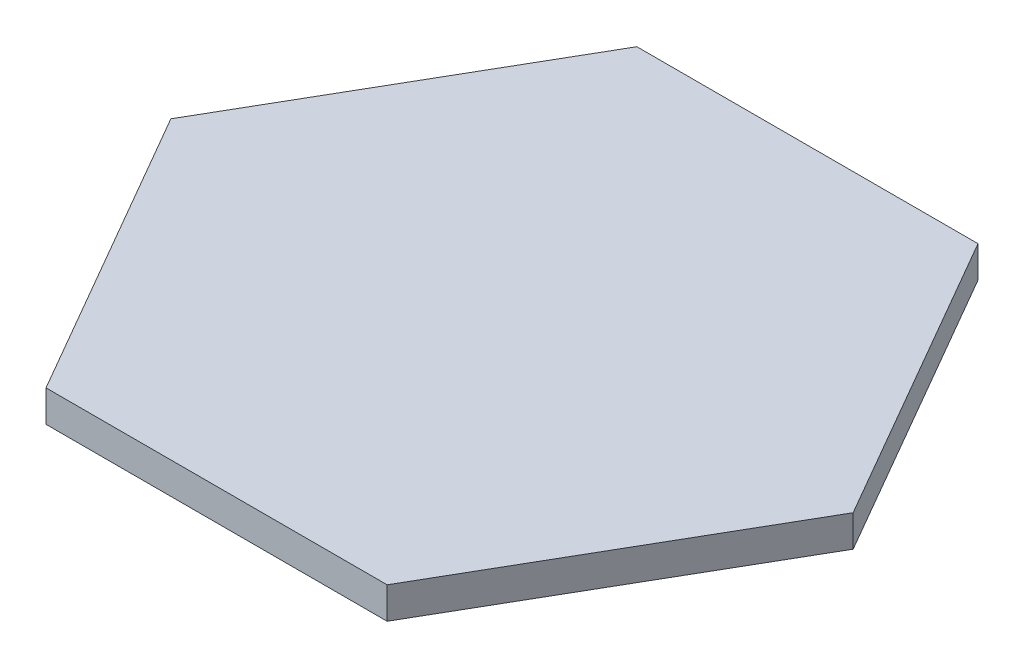
ISO-10303-21;
HEADER;
FILE_DESCRIPTION(('STEP AP214'),'2;1');
FILE_NAME('part.step','',(''),(''),'','','');
FILE_SCHEMA(('AUTOMOTIVE_DESIGN { 1 0 10303 214 1 1 1 1 }'));
ENDSEC;
DATA;
#1=APPLICATION_CONTEXT('core data for automotive mechanical design processes');
#2=APPLICATION_PROTOCOL_DEFINITION('international standard','automotive_design',2000,#1);
#3=PRODUCT_CONTEXT('',#1,'mechanical');
#4=PRODUCT('Part','Part','',(#3));
#5=PRODUCT_RELATED_PRODUCT_CATEGORY('part','',(#4));
#6=PRODUCT_DEFINITION_FORMATION('','',#4);
#7=PRODUCT_DEFINITION_CONTEXT('part definition',#1,'design');
#8=PRODUCT_DEFINITION('design','',#6,#7);
#9=PRODUCT_DEFINITION_SHAPE('','',#8);
#10=(LENGTH_UNIT() NAMED_UNIT(*) SI_UNIT(.MILLI.,.METRE.));
#11=(NAMED_UNIT(*) PLANE_ANGLE_UNIT() SI_UNIT($,.RADIAN.));
#12=(NAMED_UNIT(*) SI_UNIT($,.STERADIAN.) SOLID_ANGLE_UNIT());
#13=UNCERTAINTY_MEASURE_WITH_UNIT(LENGTH_MEASURE(1.E-05),#10,'distance_accuracy_value','');
#14=(GEOMETRIC_REPRESENTATION_CONTEXT(3) GLOBAL_UNCERTAINTY_ASSIGNED_CONTEXT((#13)) GLOBAL_UNIT_ASSIGNED_CONTEXT((#10,
#11,#12)) REPRESENTATION_CONTEXT('',''));
#15=CARTESIAN_POINT('',(0.,0.,0.));
#16=DIRECTION('',(0.,0.,1.));
#17=DIRECTION('',(1.,0.,0.));
#18=AXIS2_PLACEMENT_3D('',#15,#16,#17);
#19=CARTESIAN_POINT('',(-10.796450033846,1.,0.));
#20=DIRECTION('',(0.866025403784439,0.,-0.5));
#21=DIRECTION('',(-0.5,0.,-0.866025403784439));
#22=AXIS2_PLACEMENT_3D('',#19,#20,#21);
#23=PLANE('',#22);
#24=DIRECTION('',(0.5,0.,0.866025403784439));
#25=VECTOR('',#24,1.);
#26=CARTESIAN_POINT('',(-10.796450033846,0.,0.));
#27=LINE('',#26,#25);
#28=CARTESIAN_POINT('',(-10.796450033846,0.,0.));
#29=VERTEX_POINT('',#28);
#30=CARTESIAN_POINT('',(-5.398225016923,0.,9.35));
#31=VERTEX_POINT('',#30);
#32=EDGE_CURVE('E132',#29,#31,#27,.T.);
#33=ORIENTED_EDGE('',*,*,#32,.T.);
#34=DIRECTION('',(0.,-1.,0.));
#35=VECTOR('',#34,1.);
#36=CARTESIAN_POINT('',(-5.398225016923,1.,9.35));
#37=LINE('',#36,#35);
#38=CARTESIAN_POINT('',(-5.398225016923,1.,9.35));
#39=VERTEX_POINT('',#38);
#40=EDGE_CURVE('E11',#39,#31,#37,.T.);
#41=ORIENTED_EDGE('',*,*,#40,.F.);
#42=DIRECTION('',(0.5,0.,0.866025403784439));
#43=VECTOR('',#42,1.);
#44=CARTESIAN_POINT('',(-10.796450033846,1.,0.));
#45=LINE('',#44,#43);
#46=CARTESIAN_POINT('',(-10.796450033846,1.,0.));
#47=VERTEX_POINT('',#46);
#48=EDGE_CURVE('E148',#47,#39,#45,.T.);
#49=ORIENTED_EDGE('',*,*,#48,.F.);
#50=DIRECTION('',(0.,-1.,0.));
#51=VECTOR('',#50,1.);
#52=CARTESIAN_POINT('',(-10.796450033846,1.,0.));
#53=LINE('',#52,#51);
#54=EDGE_CURVE('E128',#47,#29,#53,.T.);
#55=ORIENTED_EDGE('',*,*,#54,.T.);
#56=EDGE_LOOP('',(#33,#41,#49,#55));
#57=FACE_BOUND('',#56,.T.);
#58=ADVANCED_FACE('F43',(#57),#23,.F.);
#59=CARTESIAN_POINT('',(-5.398225016923,1.,9.35));
#60=DIRECTION('',(0.,0.,-1.));
#61=DIRECTION('',(-1.,0.,0.));
#62=AXIS2_PLACEMENT_3D('',#59,#60,#61);
#63=PLANE('',#62);
#64=DIRECTION('',(1.,0.,0.));
#65=VECTOR('',#64,1.);
#66=CARTESIAN_POINT('',(-5.398225016923,0.,9.35));
#67=LINE('',#66,#65);
#68=CARTESIAN_POINT('',(5.398225016923,0.,9.35));
#69=VERTEX_POINT('',#68);
#70=EDGE_CURVE('E136',#31,#69,#67,.T.);
#71=ORIENTED_EDGE('',*,*,#70,.T.);
#72=DIRECTION('',(0.,-1.,0.));
#73=VECTOR('',#72,1.);
#74=CARTESIAN_POINT('',(5.398225016923,1.,9.35));
#75=LINE('',#74,#73);
#76=CARTESIAN_POINT('',(5.398225016923,1.,9.35));
#77=VERTEX_POINT('',#76);
#78=EDGE_CURVE('E52',#77,#69,#75,.T.);
#79=ORIENTED_EDGE('',*,*,#78,.F.);
#80=DIRECTION('',(1.,0.,0.));
#81=VECTOR('',#80,1.);
#82=CARTESIAN_POINT('',(-5.398225016923,1.,9.35));
#83=LINE('',#82,#81);
#84=EDGE_CURVE('E97',#39,#77,#83,.T.);
#85=ORIENTED_EDGE('',*,*,#84,.F.);
#86=ORIENTED_EDGE('',*,*,#40,.T.);
#87=EDGE_LOOP('',(#71,#79,#85,#86));
#88=FACE_BOUND('',#87,.T.);
#89=ADVANCED_FACE('F176',(#88),#63,.F.);
#90=CARTESIAN_POINT('',(5.398225016923,1.,9.35));
#91=DIRECTION('',(-0.866025403784439,0.,-0.5));
#92=DIRECTION('',(-0.5,0.,0.866025403784439));
#93=AXIS2_PLACEMENT_3D('',#90,#91,#92);
#94=PLANE('',#93);
#95=DIRECTION('',(0.5,0.,-0.866025403784439));
#96=VECTOR('',#95,1.);
#97=CARTESIAN_POINT('',(5.398225016923,0.,9.35));
#98=LINE('',#97,#96);
#99=CARTESIAN_POINT('',(10.796450033846,0.,0.));
#100=VERTEX_POINT('',#99);
#101=EDGE_CURVE('E139',#69,#100,#98,.T.);
#102=ORIENTED_EDGE('',*,*,#101,.T.);
#103=DIRECTION('',(0.,-1.,0.));
#104=VECTOR('',#103,1.);
#105=CARTESIAN_POINT('',(10.796450033846,1.,0.));
#106=LINE('',#105,#104);
#107=CARTESIAN_POINT('',(10.796450033846,1.,0.));
#108=VERTEX_POINT('',#107);
#109=EDGE_CURVE('E121',#108,#100,#106,.T.);
#110=ORIENTED_EDGE('',*,*,#109,.F.);
#111=DIRECTION('',(0.5,0.,-0.866025403784439));
#112=VECTOR('',#111,1.);
#113=CARTESIAN_POINT('',(5.398225016923,1.,9.35));
#114=LINE('',#113,#112);
#115=EDGE_CURVE('E110',#77,#108,#114,.T.);
#116=ORIENTED_EDGE('',*,*,#115,.F.);
#117=ORIENTED_EDGE('',*,*,#78,.T.);
#118=EDGE_LOOP('',(#102,#110,#116,#117));
#119=FACE_BOUND('',#118,.T.);
#120=ADVANCED_FACE('F158',(#119),#94,.F.);
#121=CARTESIAN_POINT('',(10.796450033846,1.,0.));
#122=DIRECTION('',(-0.866025403784439,0.,0.5));
#123=DIRECTION('',(0.5,0.,0.866025403784439));
#124=AXIS2_PLACEMENT_3D('',#121,#122,#123);
#125=PLANE('',#124);
#126=DIRECTION('',(-0.5,0.,-0.866025403784439));
#127=VECTOR('',#126,1.);
#128=CARTESIAN_POINT('',(10.796450033846,0.,0.));
#129=LINE('',#128,#127);
#130=CARTESIAN_POINT('',(5.39822501692299,0.,-9.35));
#131=VERTEX_POINT('',#130);
#132=EDGE_CURVE('E119',#100,#131,#129,.T.);
#133=ORIENTED_EDGE('',*,*,#132,.T.);
#134=DIRECTION('',(0.,-1.,0.));
#135=VECTOR('',#134,1.);
#136=CARTESIAN_POINT('',(5.39822501692299,1.,-9.35));
#137=LINE('',#136,#135);
#138=CARTESIAN_POINT('',(5.39822501692299,1.,-9.35));
#139=VERTEX_POINT('',#138);
#140=EDGE_CURVE('E116',#139,#131,#137,.T.);
#141=ORIENTED_EDGE('',*,*,#140,.F.);
#142=DIRECTION('',(-0.5,0.,-0.866025403784439));
#143=VECTOR('',#142,1.);
#144=CARTESIAN_POINT('',(10.796450033846,1.,0.));
#145=LINE('',#144,#143);
#146=EDGE_CURVE('E104',#108,#139,#145,.T.);
#147=ORIENTED_EDGE('',*,*,#146,.F.);
#148=ORIENTED_EDGE('',*,*,#109,.T.);
#149=EDGE_LOOP('',(#133,#141,#147,#148));
#150=FACE_BOUND('',#149,.T.);
#151=ADVANCED_FACE('F117',(#150),#125,.F.);
#152=CARTESIAN_POINT('',(5.39822501692299,1.,-9.35));
#153=DIRECTION('',(0.,0.,1.));
#154=DIRECTION('',(1.,0.,0.));
#155=AXIS2_PLACEMENT_3D('',#152,#153,#154);
#156=PLANE('',#155);
#157=DIRECTION('',(-1.,0.,0.));
#158=VECTOR('',#157,1.);
#159=CARTESIAN_POINT('',(5.39822501692299,0.,-9.35));
#160=LINE('',#159,#158);
#161=CARTESIAN_POINT('',(-5.398225016923,0.,-9.35));
#162=VERTEX_POINT('',#161);
#163=EDGE_CURVE('E83',#131,#162,#160,.T.);
#164=ORIENTED_EDGE('',*,*,#163,.T.);
#165=DIRECTION('',(0.,-1.,0.));
#166=VECTOR('',#165,1.);
#167=CARTESIAN_POINT('',(-5.398225016923,1.,-9.35));
#168=LINE('',#167,#166);
#169=CARTESIAN_POINT('',(-5.398225016923,1.,-9.35));
#170=VERTEX_POINT('',#169);
#171=EDGE_CURVE('E122',#170,#162,#168,.T.);
#172=ORIENTED_EDGE('',*,*,#171,.F.);
#173=DIRECTION('',(-1.,0.,0.));
#174=VECTOR('',#173,1.);
#175=CARTESIAN_POINT('',(5.39822501692299,1.,-9.35));
#176=LINE('',#175,#174);
#177=EDGE_CURVE('E108',#139,#170,#176,.T.);
#178=ORIENTED_EDGE('',*,*,#177,.F.);
#179=ORIENTED_EDGE('',*,*,#140,.T.);
#180=EDGE_LOOP('',(#164,#172,#178,#179));
#181=FACE_BOUND('',#180,.T.);
#182=ADVANCED_FACE('F124',(#181),#156,.F.);
#183=CARTESIAN_POINT('',(-5.398225016923,1.,-9.35));
#184=DIRECTION('',(0.866025403784439,0.,0.5));
#185=DIRECTION('',(0.5,0.,-0.866025403784439));
#186=AXIS2_PLACEMENT_3D('',#183,#184,#185);
#187=PLANE('',#186);
#188=DIRECTION('',(-0.5,0.,0.866025403784439));
#189=VECTOR('',#188,1.);
#190=CARTESIAN_POINT('',(-5.398225016923,0.,-9.35));
#191=LINE('',#190,#189);
#192=EDGE_CURVE('E89',#162,#29,#191,.T.);
#193=ORIENTED_EDGE('',*,*,#192,.T.);
#194=ORIENTED_EDGE('',*,*,#54,.F.);
#195=DIRECTION('',(-0.5,0.,0.866025403784439));
#196=VECTOR('',#195,1.);
#197=CARTESIAN_POINT('',(-5.398225016923,1.,-9.35));
#198=LINE('',#197,#196);
#199=EDGE_CURVE('E60',#170,#47,#198,.T.);
#200=ORIENTED_EDGE('',*,*,#199,.F.);
#201=ORIENTED_EDGE('',*,*,#171,.T.);
#202=EDGE_LOOP('',(#193,#194,#200,#201));
#203=FACE_BOUND('',#202,.T.);
#204=ADVANCED_FACE('F165',(#203),#187,.F.);
#205=CARTESIAN_POINT('',(0.,1.,0.));
#206=DIRECTION('',(0.,1.,0.));
#207=DIRECTION('',(0.,0.,1.));
#208=AXIS2_PLACEMENT_3D('',#205,#206,#207);
#209=PLANE('',#208);
#210=ORIENTED_EDGE('',*,*,#48,.T.);
#211=ORIENTED_EDGE('',*,*,#84,.T.);
#212=ORIENTED_EDGE('',*,*,#115,.T.);
#213=ORIENTED_EDGE('',*,*,#146,.T.);
#214=ORIENTED_EDGE('',*,*,#177,.T.);
#215=ORIENTED_EDGE('',*,*,#199,.T.);
#216=EDGE_LOOP('',(#210,#211,#212,#213,#214,#215));
#217=FACE_BOUND('',#216,.T.);
#218=ADVANCED_FACE('F106',(#217),#209,.T.);
#219=CARTESIAN_POINT('',(0.,0.,0.));
#220=DIRECTION('',(0.,1.,0.));
#221=DIRECTION('',(0.,0.,1.));
#222=AXIS2_PLACEMENT_3D('',#219,#220,#221);
#223=PLANE('',#222);
#224=ORIENTED_EDGE('',*,*,#32,.F.);
#225=ORIENTED_EDGE('',*,*,#192,.F.);
#226=ORIENTED_EDGE('',*,*,#163,.F.);
#227=ORIENTED_EDGE('',*,*,#132,.F.);
#228=ORIENTED_EDGE('',*,*,#101,.F.);
#229=ORIENTED_EDGE('',*,*,#70,.F.);
#230=EDGE_LOOP('',(#224,#225,#226,#227,#228,#229));
#231=FACE_BOUND('',#230,.T.);
#232=ADVANCED_FACE('F161',(#231),#223,.F.);
#233=CLOSED_SHELL('',(#58,#89,#120,#151,#182,#204,#218,#232));
#234=MANIFOLD_SOLID_BREP('B2',#233);
#235=ADVANCED_BREP_SHAPE_REPRESENTATION('',(#18,#234),#14);
#236=SHAPE_DEFINITION_REPRESENTATION(#9,#235);
ENDSEC;
END-ISO-10303-21;
